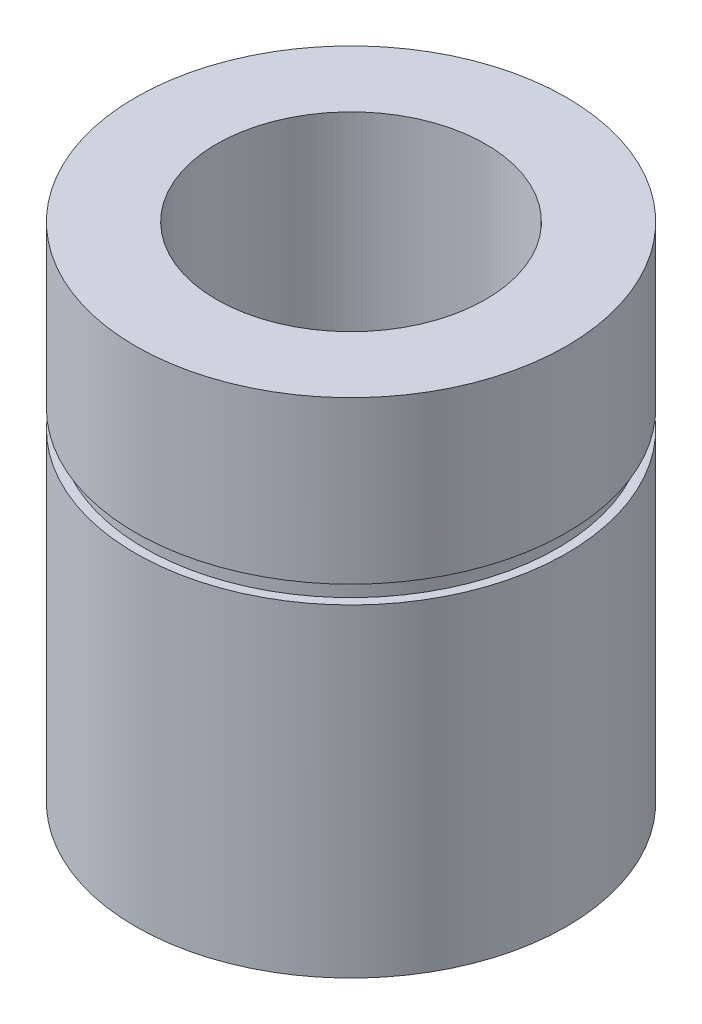
ISO-10303-21;
HEADER;
FILE_DESCRIPTION(('STEP AP214'),'2;1');
FILE_NAME('part.step','',(''),(''),'','','');
FILE_SCHEMA(('AUTOMOTIVE_DESIGN { 1 0 10303 214 1 1 1 1 }'));
ENDSEC;
DATA;
#1=APPLICATION_CONTEXT('core data for automotive mechanical design processes');
#2=APPLICATION_PROTOCOL_DEFINITION('international standard','automotive_design',2000,#1);
#3=PRODUCT_CONTEXT('',#1,'mechanical');
#4=PRODUCT('Part','Part','',(#3));
#5=PRODUCT_RELATED_PRODUCT_CATEGORY('part','',(#4));
#6=PRODUCT_DEFINITION_FORMATION('','',#4);
#7=PRODUCT_DEFINITION_CONTEXT('part definition',#1,'design');
#8=PRODUCT_DEFINITION('design','',#6,#7);
#9=PRODUCT_DEFINITION_SHAPE('','',#8);
#10=(LENGTH_UNIT() NAMED_UNIT(*) SI_UNIT(.MILLI.,.METRE.));
#11=(NAMED_UNIT(*) PLANE_ANGLE_UNIT() SI_UNIT($,.RADIAN.));
#12=(NAMED_UNIT(*) SI_UNIT($,.STERADIAN.) SOLID_ANGLE_UNIT());
#13=UNCERTAINTY_MEASURE_WITH_UNIT(LENGTH_MEASURE(1.E-05),#10,'distance_accuracy_value','');
#14=(GEOMETRIC_REPRESENTATION_CONTEXT(3) GLOBAL_UNCERTAINTY_ASSIGNED_CONTEXT((#13)) GLOBAL_UNIT_ASSIGNED_CONTEXT((#10,
#11,#12)) REPRESENTATION_CONTEXT('',''));
#15=CARTESIAN_POINT('',(0.,0.,0.));
#16=DIRECTION('',(0.,0.,1.));
#17=DIRECTION('',(1.,0.,0.));
#18=AXIS2_PLACEMENT_3D('',#15,#16,#17);
#19=CARTESIAN_POINT('',(0.,28.,0.));
#20=DIRECTION('',(0.,-1.,0.));
#21=DIRECTION('',(0.,0.,-1.));
#22=AXIS2_PLACEMENT_3D('',#19,#20,#21);
#23=CYLINDRICAL_SURFACE('',#22,12.);
#24=CARTESIAN_POINT('',(0.,28.,0.));
#25=DIRECTION('',(0.,1.,0.));
#26=DIRECTION('',(0.,0.,1.));
#27=AXIS2_PLACEMENT_3D('',#24,#25,#26);
#28=CIRCLE('',#27,12.);
#29=CARTESIAN_POINT('',(0.,28.,12.));
#30=VERTEX_POINT('',#29);
#31=EDGE_CURVE('E10',#30,#30,#28,.T.);
#32=ORIENTED_EDGE('',*,*,#31,.F.);
#33=EDGE_LOOP('',(#32));
#34=FACE_BOUND('',#33,.T.);
#35=CARTESIAN_POINT('',(0.,19.,0.));
#36=DIRECTION('',(0.,-1.,0.));
#37=DIRECTION('',(0.,0.,-1.));
#38=AXIS2_PLACEMENT_3D('',#35,#36,#37);
#39=CIRCLE('',#38,12.);
#40=CARTESIAN_POINT('',(0.,19.,-12.));
#41=VERTEX_POINT('',#40);
#42=EDGE_CURVE('E51',#41,#41,#39,.T.);
#43=ORIENTED_EDGE('',*,*,#42,.F.);
#44=EDGE_LOOP('',(#43));
#45=FACE_BOUND('',#44,.T.);
#46=ADVANCED_FACE('F32',(#34,#45),#23,.T.);
#47=CARTESIAN_POINT('',(0.,28.,0.));
#48=DIRECTION('',(0.,1.,0.));
#49=DIRECTION('',(0.,0.,1.));
#50=AXIS2_PLACEMENT_3D('',#47,#48,#49);
#51=PLANE('',#50);
#52=ORIENTED_EDGE('',*,*,#31,.T.);
#53=EDGE_LOOP('',(#52));
#54=FACE_BOUND('',#53,.T.);
#55=CARTESIAN_POINT('',(0.,28.,0.));
#56=DIRECTION('',(0.,1.,0.));
#57=DIRECTION('',(0.,0.,1.));
#58=AXIS2_PLACEMENT_3D('',#55,#56,#57);
#59=CIRCLE('',#58,7.5);
#60=CARTESIAN_POINT('',(0.,28.,7.5));
#61=VERTEX_POINT('',#60);
#62=EDGE_CURVE('E43',#61,#61,#59,.T.);
#63=ORIENTED_EDGE('',*,*,#62,.F.);
#64=EDGE_LOOP('',(#63));
#65=FACE_BOUND('',#64,.T.);
#66=ADVANCED_FACE('F83',(#54,#65),#51,.T.);
#67=CARTESIAN_POINT('',(0.,0.,0.));
#68=DIRECTION('',(0.,1.,0.));
#69=DIRECTION('',(0.,0.,1.));
#70=AXIS2_PLACEMENT_3D('',#67,#68,#69);
#71=PLANE('',#70);
#72=CARTESIAN_POINT('',(0.,0.,0.));
#73=DIRECTION('',(0.,1.,0.));
#74=DIRECTION('',(0.,0.,1.));
#75=AXIS2_PLACEMENT_3D('',#72,#73,#74);
#76=CIRCLE('',#75,12.);
#77=CARTESIAN_POINT('',(0.,0.,12.));
#78=VERTEX_POINT('',#77);
#79=EDGE_CURVE('E36',#78,#78,#76,.T.);
#80=ORIENTED_EDGE('',*,*,#79,.F.);
#81=EDGE_LOOP('',(#80));
#82=FACE_BOUND('',#81,.T.);
#83=CARTESIAN_POINT('',(0.,0.,0.));
#84=DIRECTION('',(0.,1.,0.));
#85=DIRECTION('',(0.,0.,1.));
#86=AXIS2_PLACEMENT_3D('',#83,#84,#85);
#87=CIRCLE('',#86,7.5);
#88=CARTESIAN_POINT('',(0.,0.,7.5));
#89=VERTEX_POINT('',#88);
#90=EDGE_CURVE('E45',#89,#89,#87,.T.);
#91=ORIENTED_EDGE('',*,*,#90,.T.);
#92=EDGE_LOOP('',(#91));
#93=FACE_BOUND('',#92,.T.);
#94=ADVANCED_FACE('F88',(#82,#93),#71,.F.);
#95=CARTESIAN_POINT('',(0.,18.,0.));
#96=DIRECTION('',(0.,-1.,0.));
#97=DIRECTION('',(0.,0.,-1.));
#98=AXIS2_PLACEMENT_3D('',#95,#96,#97);
#99=CIRCLE('',#98,12.);
#100=CARTESIAN_POINT('',(0.,18.,-12.));
#101=VERTEX_POINT('',#100);
#102=EDGE_CURVE('E48',#101,#101,#99,.T.);
#103=ORIENTED_EDGE('',*,*,#102,.T.);
#104=EDGE_LOOP('',(#103));
#105=FACE_BOUND('',#104,.T.);
#106=ORIENTED_EDGE('',*,*,#79,.T.);
#107=EDGE_LOOP('',(#106));
#108=FACE_BOUND('',#107,.T.);
#109=ADVANCED_FACE('F34',(#105,#108),#23,.T.);
#110=CARTESIAN_POINT('',(0.,28.,0.));
#111=DIRECTION('',(0.,-1.,0.));
#112=DIRECTION('',(0.,0.,-1.));
#113=AXIS2_PLACEMENT_3D('',#110,#111,#112);
#114=CYLINDRICAL_SURFACE('',#113,7.5);
#115=ORIENTED_EDGE('',*,*,#62,.T.);
#116=EDGE_LOOP('',(#115));
#117=FACE_BOUND('',#116,.T.);
#118=ORIENTED_EDGE('',*,*,#90,.F.);
#119=EDGE_LOOP('',(#118));
#120=FACE_BOUND('',#119,.T.);
#121=ADVANCED_FACE('F78',(#117,#120),#114,.F.);
#122=CARTESIAN_POINT('',(0.,18.,0.));
#123=DIRECTION('',(0.,-1.,0.));
#124=DIRECTION('',(0.,0.,-1.));
#125=AXIS2_PLACEMENT_3D('',#122,#123,#124);
#126=PLANE('',#125);
#127=ORIENTED_EDGE('',*,*,#102,.F.);
#128=EDGE_LOOP('',(#127));
#129=FACE_BOUND('',#128,.T.);
#130=CARTESIAN_POINT('',(0.,18.,0.));
#131=DIRECTION('',(0.,-1.,0.));
#132=DIRECTION('',(0.,0.,-1.));
#133=AXIS2_PLACEMENT_3D('',#130,#131,#132);
#134=CIRCLE('',#133,11.5);
#135=CARTESIAN_POINT('',(0.,18.,-11.5));
#136=VERTEX_POINT('',#135);
#137=EDGE_CURVE('E54',#136,#136,#134,.T.);
#138=ORIENTED_EDGE('',*,*,#137,.T.);
#139=EDGE_LOOP('',(#138));
#140=FACE_BOUND('',#139,.T.);
#141=ADVANCED_FACE('F63',(#129,#140),#126,.F.);
#142=CARTESIAN_POINT('',(0.,19.,0.));
#143=DIRECTION('',(0.,-1.,0.));
#144=DIRECTION('',(0.,0.,-1.));
#145=AXIS2_PLACEMENT_3D('',#142,#143,#144);
#146=PLANE('',#145);
#147=ORIENTED_EDGE('',*,*,#42,.T.);
#148=EDGE_LOOP('',(#147));
#149=FACE_BOUND('',#148,.T.);
#150=CARTESIAN_POINT('',(0.,19.,0.));
#151=DIRECTION('',(0.,-1.,0.));
#152=DIRECTION('',(0.,0.,-1.));
#153=AXIS2_PLACEMENT_3D('',#150,#151,#152);
#154=CIRCLE('',#153,11.5);
#155=CARTESIAN_POINT('',(0.,19.,-11.5));
#156=VERTEX_POINT('',#155);
#157=EDGE_CURVE('E57',#156,#156,#154,.T.);
#158=ORIENTED_EDGE('',*,*,#157,.F.);
#159=EDGE_LOOP('',(#158));
#160=FACE_BOUND('',#159,.T.);
#161=ADVANCED_FACE('F68',(#149,#160),#146,.T.);
#162=CARTESIAN_POINT('',(0.,18.,0.));
#163=DIRECTION('',(0.,1.,0.));
#164=DIRECTION('',(0.,0.,1.));
#165=AXIS2_PLACEMENT_3D('',#162,#163,#164);
#166=CYLINDRICAL_SURFACE('',#165,11.5);
#167=ORIENTED_EDGE('',*,*,#137,.F.);
#168=EDGE_LOOP('',(#167));
#169=FACE_BOUND('',#168,.T.);
#170=ORIENTED_EDGE('',*,*,#157,.T.);
#171=EDGE_LOOP('',(#170));
#172=FACE_BOUND('',#171,.T.);
#173=ADVANCED_FACE('F65',(#169,#172),#166,.T.);
#174=CLOSED_SHELL('',(#46,#66,#94,#109,#121,#141,#161,#173));
#175=MANIFOLD_SOLID_BREP('B2',#174);
#176=ADVANCED_BREP_SHAPE_REPRESENTATION('',(#18,#175),#14);
#177=SHAPE_DEFINITION_REPRESENTATION(#9,#176);
ENDSEC;
END-ISO-10303-21;
